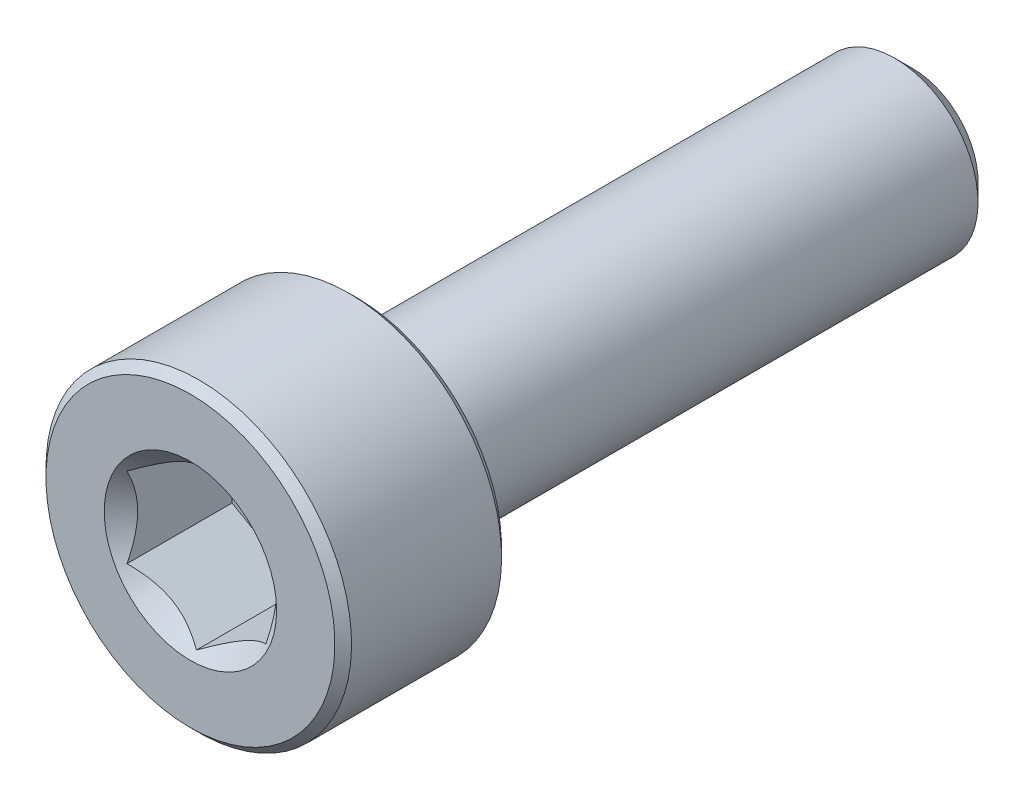
ISO-10303-21;
HEADER;
FILE_DESCRIPTION(('STEP AP214'),'2;1');
FILE_NAME('part.step','',(''),(''),'','','');
FILE_SCHEMA(('AUTOMOTIVE_DESIGN { 1 0 10303 214 1 1 1 1 }'));
ENDSEC;
DATA;
#1=APPLICATION_CONTEXT('core data for automotive mechanical design processes');
#2=APPLICATION_PROTOCOL_DEFINITION('international standard','automotive_design',2000,#1);
#3=PRODUCT_CONTEXT('',#1,'mechanical');
#4=PRODUCT('Part','Part','',(#3));
#5=PRODUCT_RELATED_PRODUCT_CATEGORY('part','',(#4));
#6=PRODUCT_DEFINITION_FORMATION('','',#4);
#7=PRODUCT_DEFINITION_CONTEXT('part definition',#1,'design');
#8=PRODUCT_DEFINITION('design','',#6,#7);
#9=PRODUCT_DEFINITION_SHAPE('','',#8);
#10=(LENGTH_UNIT() NAMED_UNIT(*) SI_UNIT(.MILLI.,.METRE.));
#11=(NAMED_UNIT(*) PLANE_ANGLE_UNIT() SI_UNIT($,.RADIAN.));
#12=(NAMED_UNIT(*) SI_UNIT($,.STERADIAN.) SOLID_ANGLE_UNIT());
#13=UNCERTAINTY_MEASURE_WITH_UNIT(LENGTH_MEASURE(1.E-05),#10,'distance_accuracy_value','');
#14=(GEOMETRIC_REPRESENTATION_CONTEXT(3) GLOBAL_UNCERTAINTY_ASSIGNED_CONTEXT((#13)) GLOBAL_UNIT_ASSIGNED_CONTEXT((#10,
#11,#12)) REPRESENTATION_CONTEXT('',''));
#15=CARTESIAN_POINT('',(0.,0.,0.));
#16=DIRECTION('',(0.,0.,1.));
#17=DIRECTION('',(1.,0.,0.));
#18=AXIS2_PLACEMENT_3D('',#15,#16,#17);
#19=CARTESIAN_POINT('',(0.,1.17524047358084,-6.5));
#20=DIRECTION('',(0.,0.,-1.));
#21=DIRECTION('',(0.,1.,0.));
#22=AXIS2_PLACEMENT_3D('',#19,#20,#21);
#23=PLANE('',#22);
#24=CARTESIAN_POINT('',(0.,0.,-6.5));
#25=DIRECTION('',(0.,0.,-1.));
#26=DIRECTION('',(0.,1.,0.));
#27=AXIS2_PLACEMENT_3D('',#24,#25,#26);
#28=CIRCLE('',#27,1.17524047358084);
#29=CARTESIAN_POINT('',(0.,1.17524047358084,-6.5));
#30=VERTEX_POINT('',#29);
#31=EDGE_CURVE('E54',#30,#30,#28,.T.);
#32=ORIENTED_EDGE('',*,*,#31,.T.);
#33=EDGE_LOOP('',(#32));
#34=FACE_BOUND('',#33,.T.);
#35=ADVANCED_FACE('F41',(#34),#23,.T.);
#36=CARTESIAN_POINT('',(0.,0.,-6.5));
#37=DIRECTION('',(0.,0.,1.));
#38=DIRECTION('',(0.,-1.,0.));
#39=AXIS2_PLACEMENT_3D('',#36,#37,#38);
#40=CONICAL_SURFACE('',#39,1.17524047358084,0.785398163397444);
#41=CARTESIAN_POINT('',(0.,0.,-6.17524047358083));
#42=DIRECTION('',(0.,0.,-1.));
#43=DIRECTION('',(0.,1.,0.));
#44=AXIS2_PLACEMENT_3D('',#41,#42,#43);
#45=CIRCLE('',#44,1.5);
#46=CARTESIAN_POINT('',(0.,1.5,-6.17524047358083));
#47=VERTEX_POINT('',#46);
#48=EDGE_CURVE('E157',#47,#47,#45,.T.);
#49=ORIENTED_EDGE('',*,*,#48,.T.);
#50=EDGE_LOOP('',(#49));
#51=FACE_BOUND('',#50,.T.);
#52=ORIENTED_EDGE('',*,*,#31,.F.);
#53=EDGE_LOOP('',(#52));
#54=FACE_BOUND('',#53,.T.);
#55=ADVANCED_FACE('F163',(#51,#54),#40,.T.);
#56=CARTESIAN_POINT('',(0.,0.,-6.5));
#57=DIRECTION('',(0.,0.,-1.));
#58=DIRECTION('',(0.,1.,0.));
#59=AXIS2_PLACEMENT_3D('',#56,#57,#58);
#60=CYLINDRICAL_SURFACE('',#59,1.5);
#61=CARTESIAN_POINT('',(0.,0.,3.35));
#62=DIRECTION('',(0.,0.,-1.));
#63=DIRECTION('',(0.,1.,0.));
#64=AXIS2_PLACEMENT_3D('',#61,#62,#63);
#65=CIRCLE('',#64,1.5);
#66=CARTESIAN_POINT('',(0.,1.5,3.35));
#67=VERTEX_POINT('',#66);
#68=EDGE_CURVE('E154',#67,#67,#65,.T.);
#69=ORIENTED_EDGE('',*,*,#68,.T.);
#70=EDGE_LOOP('',(#69));
#71=FACE_BOUND('',#70,.T.);
#72=ORIENTED_EDGE('',*,*,#48,.F.);
#73=EDGE_LOOP('',(#72));
#74=FACE_BOUND('',#73,.T.);
#75=ADVANCED_FACE('F165',(#71,#74),#60,.T.);
#76=CARTESIAN_POINT('',(0.,0.,3.35));
#77=DIRECTION('',(0.,0.,-1.));
#78=DIRECTION('',(0.,1.,0.));
#79=AXIS2_PLACEMENT_3D('',#76,#77,#78);
#80=TOROIDAL_SURFACE('',#79,1.65,0.15);
#81=CARTESIAN_POINT('',(0.,0.,3.5));
#82=DIRECTION('',(0.,0.,-1.));
#83=DIRECTION('',(0.,1.,0.));
#84=AXIS2_PLACEMENT_3D('',#81,#82,#83);
#85=CIRCLE('',#84,1.65);
#86=CARTESIAN_POINT('',(0.,1.65,3.5));
#87=VERTEX_POINT('',#86);
#88=EDGE_CURVE('E151',#87,#87,#85,.T.);
#89=ORIENTED_EDGE('',*,*,#88,.T.);
#90=EDGE_LOOP('',(#89));
#91=FACE_BOUND('',#90,.T.);
#92=ORIENTED_EDGE('',*,*,#68,.F.);
#93=EDGE_LOOP('',(#92));
#94=FACE_BOUND('',#93,.T.);
#95=ADVANCED_FACE('F171',(#91,#94),#80,.F.);
#96=CARTESIAN_POINT('',(0.,2.6,3.5));
#97=DIRECTION('',(0.,0.,-1.));
#98=DIRECTION('',(0.,1.,0.));
#99=AXIS2_PLACEMENT_3D('',#96,#97,#98);
#100=PLANE('',#99);
#101=CARTESIAN_POINT('',(0.,0.,3.5));
#102=DIRECTION('',(0.,0.,-1.));
#103=DIRECTION('',(0.,1.,0.));
#104=AXIS2_PLACEMENT_3D('',#101,#102,#103);
#105=CIRCLE('',#104,2.6);
#106=CARTESIAN_POINT('',(0.,2.6,3.5));
#107=VERTEX_POINT('',#106);
#108=EDGE_CURVE('E148',#107,#107,#105,.T.);
#109=ORIENTED_EDGE('',*,*,#108,.T.);
#110=EDGE_LOOP('',(#109));
#111=FACE_BOUND('',#110,.T.);
#112=ORIENTED_EDGE('',*,*,#88,.F.);
#113=EDGE_LOOP('',(#112));
#114=FACE_BOUND('',#113,.T.);
#115=ADVANCED_FACE('F177',(#111,#114),#100,.T.);
#116=CARTESIAN_POINT('',(0.,0.,3.5));
#117=DIRECTION('',(0.,0.,1.));
#118=DIRECTION('',(0.,-1.,0.));
#119=AXIS2_PLACEMENT_3D('',#116,#117,#118);
#120=CONICAL_SURFACE('',#119,2.6,0.785398163397445);
#121=CARTESIAN_POINT('',(0.,0.,3.65));
#122=DIRECTION('',(0.,0.,-1.));
#123=DIRECTION('',(0.,1.,0.));
#124=AXIS2_PLACEMENT_3D('',#121,#122,#123);
#125=CIRCLE('',#124,2.75);
#126=CARTESIAN_POINT('',(0.,2.75,3.65));
#127=VERTEX_POINT('',#126);
#128=EDGE_CURVE('E145',#127,#127,#125,.T.);
#129=ORIENTED_EDGE('',*,*,#128,.T.);
#130=EDGE_LOOP('',(#129));
#131=FACE_BOUND('',#130,.T.);
#132=ORIENTED_EDGE('',*,*,#108,.F.);
#133=EDGE_LOOP('',(#132));
#134=FACE_BOUND('',#133,.T.);
#135=ADVANCED_FACE('F181',(#131,#134),#120,.T.);
#136=CARTESIAN_POINT('',(0.,0.,-6.5));
#137=DIRECTION('',(0.,0.,-1.));
#138=DIRECTION('',(0.,1.,0.));
#139=AXIS2_PLACEMENT_3D('',#136,#137,#138);
#140=CYLINDRICAL_SURFACE('',#139,2.75);
#141=CARTESIAN_POINT('',(0.,0.,6.35));
#142=DIRECTION('',(0.,0.,-1.));
#143=DIRECTION('',(0.,1.,0.));
#144=AXIS2_PLACEMENT_3D('',#141,#142,#143);
#145=CIRCLE('',#144,2.75);
#146=CARTESIAN_POINT('',(0.,2.75,6.35));
#147=VERTEX_POINT('',#146);
#148=EDGE_CURVE('E142',#147,#147,#145,.T.);
#149=ORIENTED_EDGE('',*,*,#148,.T.);
#150=EDGE_LOOP('',(#149));
#151=FACE_BOUND('',#150,.T.);
#152=ORIENTED_EDGE('',*,*,#128,.F.);
#153=EDGE_LOOP('',(#152));
#154=FACE_BOUND('',#153,.T.);
#155=ADVANCED_FACE('F185',(#151,#154),#140,.T.);
#156=CARTESIAN_POINT('',(0.,0.,6.35));
#157=DIRECTION('',(0.,0.,-1.));
#158=DIRECTION('',(0.,1.,0.));
#159=AXIS2_PLACEMENT_3D('',#156,#157,#158);
#160=CONICAL_SURFACE('',#159,2.75,0.785398163397451);
#161=CARTESIAN_POINT('',(0.,0.,6.5));
#162=DIRECTION('',(0.,0.,-1.));
#163=DIRECTION('',(0.,1.,0.));
#164=AXIS2_PLACEMENT_3D('',#161,#162,#163);
#165=CIRCLE('',#164,2.6);
#166=CARTESIAN_POINT('',(0.,2.6,6.5));
#167=VERTEX_POINT('',#166);
#168=EDGE_CURVE('E139',#167,#167,#165,.T.);
#169=ORIENTED_EDGE('',*,*,#168,.T.);
#170=EDGE_LOOP('',(#169));
#171=FACE_BOUND('',#170,.T.);
#172=ORIENTED_EDGE('',*,*,#148,.F.);
#173=EDGE_LOOP('',(#172));
#174=FACE_BOUND('',#173,.T.);
#175=ADVANCED_FACE('F189',(#171,#174),#160,.T.);
#176=CARTESIAN_POINT('',(0.,0.,6.5));
#177=DIRECTION('',(0.,0.,1.));
#178=DIRECTION('',(0.,-1.,0.));
#179=AXIS2_PLACEMENT_3D('',#176,#177,#178);
#180=PLANE('',#179);
#181=CARTESIAN_POINT('',(0.,0.,6.5));
#182=DIRECTION('',(0.,0.,1.));
#183=DIRECTION('',(1.,0.,0.));
#184=AXIS2_PLACEMENT_3D('',#181,#182,#183);
#185=CIRCLE('',#184,1.55162884844712);
#186=CARTESIAN_POINT('',(1.55162884844712,0.,6.5));
#187=VERTEX_POINT('',#186);
#188=EDGE_CURVE('E113',#187,#187,#185,.T.);
#189=ORIENTED_EDGE('',*,*,#188,.F.);
#190=EDGE_LOOP('',(#189));
#191=FACE_BOUND('',#190,.T.);
#192=ORIENTED_EDGE('',*,*,#168,.F.);
#193=EDGE_LOOP('',(#192));
#194=FACE_BOUND('',#193,.T.);
#195=ADVANCED_FACE('F193',(#191,#194),#180,.T.);
#196=CARTESIAN_POINT('',(0.,0.,6.5));
#197=DIRECTION('',(0.,0.,1.));
#198=DIRECTION('',(1.,0.,0.));
#199=AXIS2_PLACEMENT_3D('',#196,#197,#198);
#200=CONICAL_SURFACE('',#199,1.55162884844712,0.78539816339745);
#201=ORIENTED_EDGE('',*,*,#188,.T.);
#202=EDGE_LOOP('',(#201));
#203=FACE_BOUND('',#202,.T.);
#204=CARTESIAN_POINT('',(-0.000199999999999347,-1.4434911430279,6.39186230843608));
#205=CARTESIAN_POINT('',(0.0427751670715874,-1.41867941875065,6.36706849258205));
#206=CARTESIAN_POINT('',(0.0864690047459488,-1.39345276980743,6.34373055894563));
#207=CARTESIAN_POINT('',(0.175565930841943,-1.34201263554194,6.30099882861148));
#208=CARTESIAN_POINT('',(0.220977498357065,-1.31579425481276,6.28162881688736));
#209=CARTESIAN_POINT('',(0.312547820935261,-1.26292610442246,6.24844730794042));
#210=CARTESIAN_POINT('',(0.358683240175886,-1.23628980770471,6.2345523835796));
#211=CARTESIAN_POINT('',(0.451970080407593,-1.18243062538508,6.21314410668758));
#212=CARTESIAN_POINT('',(0.499118649136381,-1.15520938653761,6.20561476609373));
#213=CARTESIAN_POINT('',(0.580373556887253,-1.10829684367467,6.19882132257765));
#214=CARTESIAN_POINT('',(0.614374876627942,-1.08866617256958,6.1978153836313));
#215=CARTESIAN_POINT('',(0.682317764432479,-1.04943932800611,6.19950823943826));
#216=CARTESIAN_POINT('',(0.716259317655659,-1.02984316311599,6.20220785174248));
#217=CARTESIAN_POINT('',(0.783814856457501,-0.990839954603499,6.21115575484332));
#218=CARTESIAN_POINT('',(0.817428507286776,-0.971433104248771,6.21740735042665));
#219=CARTESIAN_POINT('',(0.884094638217814,-0.932943395609905,6.23312250594085));
#220=CARTESIAN_POINT('',(0.917146871030297,-0.9138606800983,6.2425874446144));
#221=CARTESIAN_POINT('',(1.00179969160027,-0.864986351354567,6.27067821521453));
#222=CARTESIAN_POINT('',(1.05286649242964,-0.835502920149075,6.29141698197915));
#223=CARTESIAN_POINT('',(1.15300085411326,-0.777690319475908,6.33813395919842));
#224=CARTESIAN_POINT('',(1.20207431157827,-0.749357745598417,6.36409512047371));
#225=CARTESIAN_POINT('',(1.2502,-0.721572366433194,6.39186230843608));
#226=B_SPLINE_CURVE_WITH_KNOTS('',3,(#204,#205,#206,#207,#208,#209,#210,#211,#212,#213,#214,
#215,#216,#217,#218,#219,#220,#221,#222,#223,#224,#225),.UNSPECIFIED.,.F.,.F.,(4,2,2,2,2,2,2,2,
2,2,4),(0.,0.166533409618304,0.334037607289762,0.498880396489698,0.663307919240275,
0.780963963458827,0.898645970148454,1.01643764860773,1.1342799317155,1.32148652032141,
1.50809158792573),.UNSPECIFIED.);
#227=CARTESIAN_POINT('',(0.,-1.44337567297406,6.39174682452695));
#228=VERTEX_POINT('',#227);
#229=CARTESIAN_POINT('',(1.25,-0.721687836487032,6.39174682452694));
#230=VERTEX_POINT('',#229);
#231=EDGE_CURVE('E12',#228,#230,#226,.T.);
#232=ORIENTED_EDGE('',*,*,#231,.F.);
#233=CARTESIAN_POINT('',(-1.2502,-0.721572366433195,6.39186230843608));
#234=CARTESIAN_POINT('',(-1.20722483292841,-0.746384090710444,6.36706849258205));
#235=CARTESIAN_POINT('',(-1.16353099525405,-0.771610739653664,6.34373055894563));
#236=CARTESIAN_POINT('',(-1.07443406915806,-0.823050873919155,6.30099882861148));
#237=CARTESIAN_POINT('',(-1.02902250164294,-0.849269254648333,6.28162881688736));
#238=CARTESIAN_POINT('',(-0.93745217906474,-0.902137405038635,6.24844730794042));
#239=CARTESIAN_POINT('',(-0.891316759824114,-0.928773701756387,6.2345523835796));
#240=CARTESIAN_POINT('',(-0.798029919592408,-0.982632884076012,6.21314410668758));
#241=CARTESIAN_POINT('',(-0.75088135086362,-1.00985412292348,6.20561476609373));
#242=CARTESIAN_POINT('',(-0.669626443112748,-1.05676666578643,6.19882132257765));
#243=CARTESIAN_POINT('',(-0.635625123372059,-1.07639733689152,6.1978153836313));
#244=CARTESIAN_POINT('',(-0.567682235567523,-1.11562418145499,6.19950823943826));
#245=CARTESIAN_POINT('',(-0.533740682344343,-1.1352203463451,6.20220785174248));
#246=CARTESIAN_POINT('',(-0.466185143542501,-1.1742235548576,6.21115575484332));
#247=CARTESIAN_POINT('',(-0.432571492713225,-1.19363040521233,6.21740735042665));
#248=CARTESIAN_POINT('',(-0.365905361782187,-1.23212011385119,6.23312250594085));
#249=CARTESIAN_POINT('',(-0.332853128969705,-1.2512028293628,6.2425874446144));
#250=CARTESIAN_POINT('',(-0.248200308399736,-1.30007715810653,6.27067821521453));
#251=CARTESIAN_POINT('',(-0.197133507570362,-1.32956058931202,6.29141698197915));
#252=CARTESIAN_POINT('',(-0.0969991458867446,-1.38737318998519,6.33813395919842));
#253=CARTESIAN_POINT('',(-0.0479256884217298,-1.41570576386268,6.36409512047371));
#254=CARTESIAN_POINT('',(0.000200000000000719,-1.4434911430279,6.39186230843608));
#255=B_SPLINE_CURVE_WITH_KNOTS('',3,(#233,#234,#235,#236,#237,#238,#239,#240,#241,#242,#243,
#244,#245,#246,#247,#248,#249,#250,#251,#252,#253,#254),.UNSPECIFIED.,.F.,.F.,(4,2,2,2,2,2,2,2,
2,2,4),(0.,0.166533409618303,0.334037607289761,0.498880396489698,0.663307919240274,
0.780963963458826,0.898645970148452,1.01643764860773,1.13427993171549,1.32148652032141,
1.50809158792574),.UNSPECIFIED.);
#256=CARTESIAN_POINT('',(-1.25,-0.721687836487032,6.39174682452694));
#257=VERTEX_POINT('',#256);
#258=EDGE_CURVE('E99',#257,#228,#255,.T.);
#259=ORIENTED_EDGE('',*,*,#258,.F.);
#260=CARTESIAN_POINT('',(-1.25,-1.52022146239345,6.91651070319084));
#261=CARTESIAN_POINT('',(-1.25,-1.48354689134962,6.88818689718723));
#262=CARTESIAN_POINT('',(-1.25,-1.44667707589305,6.86011672093047));
#263=CARTESIAN_POINT('',(-1.25,-1.37246477804769,6.80459065501776));
#264=CARTESIAN_POINT('',(-1.25,-1.33512218721453,6.77713491044787));
#265=CARTESIAN_POINT('',(-1.25,-1.22171630832114,6.69545809771049));
#266=CARTESIAN_POINT('',(-1.25,-1.14482995781092,6.6423614251193));
#267=CARTESIAN_POINT('',(-1.25,-0.983056768942587,6.53734973416941));
#268=CARTESIAN_POINT('',(-1.25,-0.897974111811057,6.48573326925832));
#269=CARTESIAN_POINT('',(-1.25,-0.723462355215556,6.39078355108508));
#270=CARTESIAN_POINT('',(-1.25,-0.634049271919706,6.34742232185916));
#271=CARTESIAN_POINT('',(-1.25,-0.5005887711437,6.29435177040724));
#272=CARTESIAN_POINT('',(-1.25,-0.45869172620811,6.27926501327173));
#273=CARTESIAN_POINT('',(-1.25,-0.373815329706779,6.25244749770266));
#274=CARTESIAN_POINT('',(-1.25,-0.330835910419723,6.24071694982871));
#275=CARTESIAN_POINT('',(-1.25,-0.244810833071148,6.22144313304601));
#276=CARTESIAN_POINT('',(-1.25,-0.20178270746757,6.21382289169453));
#277=CARTESIAN_POINT('',(-1.25,-0.115176247984995,6.20293190707962));
#278=CARTESIAN_POINT('',(-1.25,-0.0715980347745597,6.1996602260857));
#279=CARTESIAN_POINT('',(-1.25,0.0136806197531966,6.19775210045869));
#280=CARTESIAN_POINT('',(-1.25,0.0553765370047047,6.19891205716704));
#281=CARTESIAN_POINT('',(-1.25,0.13844909645316,6.20533266388464));
#282=CARTESIAN_POINT('',(-1.25,0.179825709781942,6.21059368038276));
#283=CARTESIAN_POINT('',(-1.25,0.262662840763598,6.22500574721218));
#284=CARTESIAN_POINT('',(-1.25,0.304111120669651,6.23422600730023));
#285=CARTESIAN_POINT('',(-1.25,0.386089884230834,6.25604235623938));
#286=CARTESIAN_POINT('',(-1.25,0.426620414510369,6.26863827317792));
#287=CARTESIAN_POINT('',(-1.25,0.550794781768362,6.3120595916479));
#288=CARTESIAN_POINT('',(-1.25,0.632755591043412,6.34768282700966));
#289=CARTESIAN_POINT('',(-1.25,0.792852508946382,6.42696814455953));
#290=CARTESIAN_POINT('',(-1.25,0.870973935410876,6.47065844211049));
#291=CARTESIAN_POINT('',(-1.25,1.02031328199646,6.56088158787621));
#292=CARTESIAN_POINT('',(-1.25,1.09168171050215,6.60716845879521));
#293=CARTESIAN_POINT('',(-1.25,1.19682802849918,6.67876149953674));
#294=CARTESIAN_POINT('',(-1.25,1.2314248214359,6.70288582787532));
#295=CARTESIAN_POINT('',(-1.25,1.30014350643268,6.75178258410313));
#296=CARTESIAN_POINT('',(-1.25,1.33426552680451,6.7765548314612));
#297=CARTESIAN_POINT('',(-1.25,1.36818950249276,6.8015960474388));
#298=B_SPLINE_CURVE_WITH_KNOTS('',3,(#260,#261,#262,#263,#264,#265,#266,#267,#268,#269,#270,
#271,#272,#273,#274,#275,#276,#277,#278,#279,#280,#281,#282,#283,#284,#285,#286,#287,#288,#289,
#290,#291,#292,#293,#294,#295,#296,#297),.UNSPECIFIED.,.F.,.F.,(4,2,2,2,2,2,2,2,2,2,2,2,2,2,2,2,
2,2,4),(0.,0.139012369615044,0.278057225136918,0.558259504053771,0.856585057342475,
1.15388088887299,1.28736138903992,1.42085026158167,1.55174393609413,1.68260937990424,
1.80753647715252,1.93247473971975,2.05969207441603,2.18690293152764,2.45422704655832,
2.72250450232039,2.97756898823762,3.10409578574714,3.23058769667827),.UNSPECIFIED.);
#299=CARTESIAN_POINT('',(-1.25,0.721687836487032,6.39174682452694));
#300=VERTEX_POINT('',#299);
#301=EDGE_CURVE('E112',#300,#257,#298,.F.);
#302=ORIENTED_EDGE('',*,*,#301,.F.);
#303=CARTESIAN_POINT('',(0.000199999999999644,1.4434911430279,6.39186230843608));
#304=CARTESIAN_POINT('',(-0.0427751670715868,1.41867941875065,6.36706849258205));
#305=CARTESIAN_POINT('',(-0.0864690047459481,1.39345276980743,6.34373055894563));
#306=CARTESIAN_POINT('',(-0.175565930841942,1.34201263554194,6.30099882861148));
#307=CARTESIAN_POINT('',(-0.220977498357064,1.31579425481276,6.28162881688736));
#308=CARTESIAN_POINT('',(-0.312547820935259,1.26292610442246,6.24844730794042));
#309=CARTESIAN_POINT('',(-0.358683240175885,1.23628980770471,6.2345523835796));
#310=CARTESIAN_POINT('',(-0.451970080407592,1.18243062538508,6.21314410668758));
#311=CARTESIAN_POINT('',(-0.49911864913638,1.15520938653761,6.20561476609373));
#312=CARTESIAN_POINT('',(-0.580373556887252,1.10829684367467,6.19882132257765));
#313=CARTESIAN_POINT('',(-0.614374876627941,1.08866617256958,6.1978153836313));
#314=CARTESIAN_POINT('',(-0.682317764432477,1.04943932800611,6.19950823943826));
#315=CARTESIAN_POINT('',(-0.716259317655657,1.02984316311599,6.20220785174248));
#316=CARTESIAN_POINT('',(-0.783814856457499,0.990839954603499,6.21115575484332));
#317=CARTESIAN_POINT('',(-0.817428507286774,0.971433104248771,6.21740735042665));
#318=CARTESIAN_POINT('',(-0.884094638217813,0.932943395609905,6.23312250594085));
#319=CARTESIAN_POINT('',(-0.917146871030295,0.9138606800983,6.2425874446144));
#320=CARTESIAN_POINT('',(-1.00179969160026,0.864986351354567,6.27067821521453));
#321=CARTESIAN_POINT('',(-1.05286649242964,0.835502920149075,6.29141698197915));
#322=CARTESIAN_POINT('',(-1.15300085411325,0.777690319475908,6.33813395919842));
#323=CARTESIAN_POINT('',(-1.20207431157827,0.749357745598416,6.36409512047371));
#324=CARTESIAN_POINT('',(-1.2502,0.721572366433194,6.39186230843608));
#325=B_SPLINE_CURVE_WITH_KNOTS('',3,(#303,#304,#305,#306,#307,#308,#309,#310,#311,#312,#313,
#314,#315,#316,#317,#318,#319,#320,#321,#322,#323,#324),.UNSPECIFIED.,.F.,.F.,(4,2,2,2,2,2,2,2,
2,2,4),(0.,0.166533409618303,0.334037607289761,0.498880396489697,0.663307919240274,
0.780963963458826,0.898645970148452,1.01643764860773,1.13427993171549,1.32148652032141,
1.50809158792574),.UNSPECIFIED.);
#326=CARTESIAN_POINT('',(0.,1.44337567297406,6.39174682452694));
#327=VERTEX_POINT('',#326);
#328=EDGE_CURVE('E243',#327,#300,#325,.T.);
#329=ORIENTED_EDGE('',*,*,#328,.F.);
#330=CARTESIAN_POINT('',(1.2502,0.721572366433194,6.39186230843608));
#331=CARTESIAN_POINT('',(1.20722483292841,0.746384090710444,6.36706849258205));
#332=CARTESIAN_POINT('',(1.16353099525405,0.771610739653664,6.34373055894563));
#333=CARTESIAN_POINT('',(1.07443406915806,0.823050873919154,6.30099882861148));
#334=CARTESIAN_POINT('',(1.02902250164294,0.849269254648333,6.28162881688736));
#335=CARTESIAN_POINT('',(0.93745217906474,0.902137405038635,6.24844730794042));
#336=CARTESIAN_POINT('',(0.891316759824114,0.928773701756387,6.2345523835796));
#337=CARTESIAN_POINT('',(0.798029919592408,0.982632884076012,6.21314410668758));
#338=CARTESIAN_POINT('',(0.750881350863621,1.00985412292348,6.20561476609373));
#339=CARTESIAN_POINT('',(0.669626443112748,1.05676666578643,6.19882132257765));
#340=CARTESIAN_POINT('',(0.635625123372059,1.07639733689152,6.19781538363129));
#341=CARTESIAN_POINT('',(0.567682235567523,1.11562418145499,6.19950823943826));
#342=CARTESIAN_POINT('',(0.533740682344343,1.1352203463451,6.20220785174248));
#343=CARTESIAN_POINT('',(0.466185143542501,1.1742235548576,6.21115575484332));
#344=CARTESIAN_POINT('',(0.432571492713226,1.19363040521233,6.21740735042665));
#345=CARTESIAN_POINT('',(0.365905361782187,1.23212011385119,6.23312250594085));
#346=CARTESIAN_POINT('',(0.332853128969705,1.2512028293628,6.2425874446144));
#347=CARTESIAN_POINT('',(0.248200308399736,1.30007715810653,6.27067821521453));
#348=CARTESIAN_POINT('',(0.197133507570362,1.32956058931202,6.29141698197915));
#349=CARTESIAN_POINT('',(0.0969991458867456,1.38737318998519,6.33813395919842));
#350=CARTESIAN_POINT('',(0.0479256884217306,1.41570576386268,6.36409512047371));
#351=CARTESIAN_POINT('',(-0.000200000000000208,1.4434911430279,6.39186230843608));
#352=B_SPLINE_CURVE_WITH_KNOTS('',3,(#330,#331,#332,#333,#334,#335,#336,#337,#338,#339,#340,
#341,#342,#343,#344,#345,#346,#347,#348,#349,#350,#351),.UNSPECIFIED.,.F.,.F.,(4,2,2,2,2,2,2,2,
2,2,4),(0.,0.166533409618303,0.334037607289761,0.498880396489698,0.663307919240274,
0.780963963458826,0.898645970148452,1.01643764860773,1.13427993171549,1.32148652032141,
1.50809158792574),.UNSPECIFIED.);
#353=CARTESIAN_POINT('',(1.25,0.721687836487032,6.39174682452694));
#354=VERTEX_POINT('',#353);
#355=EDGE_CURVE('E216',#354,#327,#352,.T.);
#356=ORIENTED_EDGE('',*,*,#355,.F.);
#357=CARTESIAN_POINT('',(1.25,-1.52022146239345,6.91651070319084));
#358=CARTESIAN_POINT('',(1.25,-1.48354689134962,6.88818689718723));
#359=CARTESIAN_POINT('',(1.25,-1.44667707589305,6.86011672093047));
#360=CARTESIAN_POINT('',(1.25,-1.37246477804769,6.80459065501776));
#361=CARTESIAN_POINT('',(1.25,-1.33512218721453,6.77713491044787));
#362=CARTESIAN_POINT('',(1.25,-1.22171630832114,6.69545809771049));
#363=CARTESIAN_POINT('',(1.25,-1.14482995781092,6.6423614251193));
#364=CARTESIAN_POINT('',(1.25,-0.983056768942587,6.53734973416941));
#365=CARTESIAN_POINT('',(1.25,-0.897974111811057,6.48573326925832));
#366=CARTESIAN_POINT('',(1.25,-0.723462355215556,6.39078355108508));
#367=CARTESIAN_POINT('',(1.25,-0.634049271919706,6.34742232185916));
#368=CARTESIAN_POINT('',(1.25,-0.500588771143699,6.29435177040724));
#369=CARTESIAN_POINT('',(1.25,-0.45869172620811,6.27926501327173));
#370=CARTESIAN_POINT('',(1.25,-0.373815329706778,6.25244749770266));
#371=CARTESIAN_POINT('',(1.25,-0.330835910419723,6.24071694982871));
#372=CARTESIAN_POINT('',(1.25,-0.244810833071148,6.22144313304601));
#373=CARTESIAN_POINT('',(1.25,-0.20178270746757,6.21382289169453));
#374=CARTESIAN_POINT('',(1.25,-0.115176247984995,6.20293190707962));
#375=CARTESIAN_POINT('',(1.25,-0.0715980347745598,6.1996602260857));
#376=CARTESIAN_POINT('',(1.25,0.0136806197531965,6.19775210045869));
#377=CARTESIAN_POINT('',(1.25,0.0553765370047047,6.19891205716704));
#378=CARTESIAN_POINT('',(1.25,0.13844909645316,6.20533266388464));
#379=CARTESIAN_POINT('',(1.25,0.179825709781942,6.21059368038276));
#380=CARTESIAN_POINT('',(1.25,0.262662840763599,6.22500574721218));
#381=CARTESIAN_POINT('',(1.25,0.304111120669651,6.23422600730023));
#382=CARTESIAN_POINT('',(1.25,0.386089884230835,6.25604235623938));
#383=CARTESIAN_POINT('',(1.25,0.426620414510369,6.26863827317792));
#384=CARTESIAN_POINT('',(1.25,0.550794781768362,6.31205959164791));
#385=CARTESIAN_POINT('',(1.25,0.632755591043412,6.34768282700966));
#386=CARTESIAN_POINT('',(1.25,0.792852508946383,6.42696814455953));
#387=CARTESIAN_POINT('',(1.25,0.870973935410876,6.47065844211049));
#388=CARTESIAN_POINT('',(1.25,1.02031328199646,6.56088158787621));
#389=CARTESIAN_POINT('',(1.25,1.09168171050215,6.60716845879521));
#390=CARTESIAN_POINT('',(1.25,1.19682802849918,6.67876149953674));
#391=CARTESIAN_POINT('',(1.25,1.2314248214359,6.70288582787532));
#392=CARTESIAN_POINT('',(1.25,1.30014350643268,6.75178258410313));
#393=CARTESIAN_POINT('',(1.25,1.33426552680451,6.7765548314612));
#394=CARTESIAN_POINT('',(1.25,1.36818950249276,6.8015960474388));
#395=B_SPLINE_CURVE_WITH_KNOTS('',3,(#357,#358,#359,#360,#361,#362,#363,#364,#365,#366,#367,
#368,#369,#370,#371,#372,#373,#374,#375,#376,#377,#378,#379,#380,#381,#382,#383,#384,#385,#386,
#387,#388,#389,#390,#391,#392,#393,#394),.UNSPECIFIED.,.F.,.F.,(4,2,2,2,2,2,2,2,2,2,2,2,2,2,2,2,
2,2,4),(0.,0.139012369615044,0.278057225136918,0.558259504053771,0.856585057342474,
1.15388088887299,1.28736138903992,1.42085026158167,1.55174393609413,1.68260937990424,
1.80753647715252,1.93247473971975,2.05969207441603,2.18690293152764,2.45422704655832,
2.72250450232039,2.97756898823762,3.10409578574714,3.23058769667827),.UNSPECIFIED.);
#396=EDGE_CURVE('E61',#230,#354,#395,.T.);
#397=ORIENTED_EDGE('',*,*,#396,.F.);
#398=EDGE_LOOP('',(#232,#259,#302,#329,#356,#397));
#399=FACE_BOUND('',#398,.T.);
#400=ADVANCED_FACE('F98',(#203,#399),#200,.F.);
#401=CARTESIAN_POINT('',(0.,2.6,4.5));
#402=DIRECTION('',(0.,0.,-1.));
#403=DIRECTION('',(0.,1.,0.));
#404=AXIS2_PLACEMENT_3D('',#401,#402,#403);
#405=PLANE('',#404);
#406=DIRECTION('',(0.866025403784438,0.5,0.));
#407=VECTOR('',#406,1.);
#408=CARTESIAN_POINT('',(0.,-1.44337567297406,4.5));
#409=LINE('',#408,#407);
#410=CARTESIAN_POINT('',(0.,-1.44337567297406,4.5));
#411=VERTEX_POINT('',#410);
#412=CARTESIAN_POINT('',(1.25,-0.721687836487032,4.5));
#413=VERTEX_POINT('',#412);
#414=EDGE_CURVE('E116',#411,#413,#409,.T.);
#415=ORIENTED_EDGE('',*,*,#414,.T.);
#416=DIRECTION('',(0.,1.,0.));
#417=VECTOR('',#416,1.);
#418=CARTESIAN_POINT('',(1.25,-0.721687836487032,4.5));
#419=LINE('',#418,#417);
#420=CARTESIAN_POINT('',(1.25,0.721687836487032,4.5));
#421=VERTEX_POINT('',#420);
#422=EDGE_CURVE('E68',#413,#421,#419,.T.);
#423=ORIENTED_EDGE('',*,*,#422,.T.);
#424=DIRECTION('',(-0.866025403784439,0.5,0.));
#425=VECTOR('',#424,1.);
#426=CARTESIAN_POINT('',(1.25,0.721687836487032,4.5));
#427=LINE('',#426,#425);
#428=CARTESIAN_POINT('',(0.,1.44337567297406,4.5));
#429=VERTEX_POINT('',#428);
#430=EDGE_CURVE('E124',#421,#429,#427,.T.);
#431=ORIENTED_EDGE('',*,*,#430,.T.);
#432=DIRECTION('',(-0.866025403784439,-0.5,0.));
#433=VECTOR('',#432,1.);
#434=CARTESIAN_POINT('',(0.,1.44337567297406,4.5));
#435=LINE('',#434,#433);
#436=CARTESIAN_POINT('',(-1.25,0.721687836487032,4.5));
#437=VERTEX_POINT('',#436);
#438=EDGE_CURVE('E131',#429,#437,#435,.T.);
#439=ORIENTED_EDGE('',*,*,#438,.T.);
#440=DIRECTION('',(0.,-1.,0.));
#441=VECTOR('',#440,1.);
#442=CARTESIAN_POINT('',(-1.25,0.721687836487032,4.5));
#443=LINE('',#442,#441);
#444=CARTESIAN_POINT('',(-1.25,-0.721687836487033,4.5));
#445=VERTEX_POINT('',#444);
#446=EDGE_CURVE('E127',#437,#445,#443,.T.);
#447=ORIENTED_EDGE('',*,*,#446,.T.);
#448=DIRECTION('',(0.866025403784439,-0.5,0.));
#449=VECTOR('',#448,1.);
#450=CARTESIAN_POINT('',(-1.25,-0.721687836487032,4.5));
#451=LINE('',#450,#449);
#452=EDGE_CURVE('E117',#445,#411,#451,.T.);
#453=ORIENTED_EDGE('',*,*,#452,.T.);
#454=EDGE_LOOP('',(#415,#423,#431,#439,#447,#453));
#455=FACE_BOUND('',#454,.T.);
#456=ADVANCED_FACE('F198',(#455),#405,.F.);
#457=CARTESIAN_POINT('',(0.,-1.44337567297406,-0.318813079129867));
#458=DIRECTION('',(0.5,-0.866025403784438,0.));
#459=DIRECTION('',(0.866025403784438,0.5,0.));
#460=AXIS2_PLACEMENT_3D('',#457,#458,#459);
#461=PLANE('',#460);
#462=DIRECTION('',(0.,0.,1.));
#463=VECTOR('',#462,1.);
#464=CARTESIAN_POINT('',(0.,-1.44337567297406,-0.318813079129867));
#465=LINE('',#464,#463);
#466=EDGE_CURVE('E108',#411,#228,#465,.T.);
#467=ORIENTED_EDGE('',*,*,#466,.T.);
#468=ORIENTED_EDGE('',*,*,#231,.T.);
#469=DIRECTION('',(0.,0.,1.));
#470=VECTOR('',#469,1.);
#471=CARTESIAN_POINT('',(1.25,-0.721687836487032,-0.318813079129867));
#472=LINE('',#471,#470);
#473=EDGE_CURVE('E119',#413,#230,#472,.T.);
#474=ORIENTED_EDGE('',*,*,#473,.F.);
#475=ORIENTED_EDGE('',*,*,#414,.F.);
#476=EDGE_LOOP('',(#467,#468,#474,#475));
#477=FACE_BOUND('',#476,.T.);
#478=ADVANCED_FACE('F115',(#477),#461,.F.);
#479=CARTESIAN_POINT('',(-1.25,-0.721687836487032,-0.318813079129867));
#480=DIRECTION('',(-0.5,-0.866025403784439,0.));
#481=DIRECTION('',(0.866025403784439,-0.5,0.));
#482=AXIS2_PLACEMENT_3D('',#479,#480,#481);
#483=PLANE('',#482);
#484=DIRECTION('',(0.,0.,1.));
#485=VECTOR('',#484,1.);
#486=CARTESIAN_POINT('',(-1.25,-0.721687836487032,-0.318813079129867));
#487=LINE('',#486,#485);
#488=EDGE_CURVE('E111',#445,#257,#487,.T.);
#489=ORIENTED_EDGE('',*,*,#488,.T.);
#490=ORIENTED_EDGE('',*,*,#258,.T.);
#491=ORIENTED_EDGE('',*,*,#466,.F.);
#492=ORIENTED_EDGE('',*,*,#452,.F.);
#493=EDGE_LOOP('',(#489,#490,#491,#492));
#494=FACE_BOUND('',#493,.T.);
#495=ADVANCED_FACE('F107',(#494),#483,.F.);
#496=CARTESIAN_POINT('',(-1.25,0.721687836487032,-0.318813079129867));
#497=DIRECTION('',(-1.,0.,0.));
#498=DIRECTION('',(0.,0.,1.));
#499=AXIS2_PLACEMENT_3D('',#496,#497,#498);
#500=PLANE('',#499);
#501=DIRECTION('',(0.,0.,1.));
#502=VECTOR('',#501,1.);
#503=CARTESIAN_POINT('',(-1.25,0.721687836487032,-0.318813079129867));
#504=LINE('',#503,#502);
#505=EDGE_CURVE('E128',#437,#300,#504,.T.);
#506=ORIENTED_EDGE('',*,*,#505,.T.);
#507=ORIENTED_EDGE('',*,*,#301,.T.);
#508=ORIENTED_EDGE('',*,*,#488,.F.);
#509=ORIENTED_EDGE('',*,*,#446,.F.);
#510=EDGE_LOOP('',(#506,#507,#508,#509));
#511=FACE_BOUND('',#510,.T.);
#512=ADVANCED_FACE('F252',(#511),#500,.F.);
#513=CARTESIAN_POINT('',(0.,1.44337567297406,-0.318813079129867));
#514=DIRECTION('',(-0.5,0.866025403784438,0.));
#515=DIRECTION('',(-0.866025403784439,-0.5,0.));
#516=AXIS2_PLACEMENT_3D('',#513,#514,#515);
#517=PLANE('',#516);
#518=DIRECTION('',(0.,0.,1.));
#519=VECTOR('',#518,1.);
#520=CARTESIAN_POINT('',(0.,1.44337567297406,-0.318813079129867));
#521=LINE('',#520,#519);
#522=EDGE_CURVE('E132',#429,#327,#521,.T.);
#523=ORIENTED_EDGE('',*,*,#522,.T.);
#524=ORIENTED_EDGE('',*,*,#328,.T.);
#525=ORIENTED_EDGE('',*,*,#505,.F.);
#526=ORIENTED_EDGE('',*,*,#438,.F.);
#527=EDGE_LOOP('',(#523,#524,#525,#526));
#528=FACE_BOUND('',#527,.T.);
#529=ADVANCED_FACE('F249',(#528),#517,.F.);
#530=CARTESIAN_POINT('',(1.25,0.721687836487032,-0.318813079129867));
#531=DIRECTION('',(0.5,0.866025403784439,0.));
#532=DIRECTION('',(-0.866025403784439,0.5,0.));
#533=AXIS2_PLACEMENT_3D('',#530,#531,#532);
#534=PLANE('',#533);
#535=DIRECTION('',(0.,0.,1.));
#536=VECTOR('',#535,1.);
#537=CARTESIAN_POINT('',(1.25,0.721687836487032,-0.318813079129867));
#538=LINE('',#537,#536);
#539=EDGE_CURVE('E135',#421,#354,#538,.T.);
#540=ORIENTED_EDGE('',*,*,#539,.T.);
#541=ORIENTED_EDGE('',*,*,#355,.T.);
#542=ORIENTED_EDGE('',*,*,#522,.F.);
#543=ORIENTED_EDGE('',*,*,#430,.F.);
#544=EDGE_LOOP('',(#540,#541,#542,#543));
#545=FACE_BOUND('',#544,.T.);
#546=ADVANCED_FACE('F206',(#545),#534,.F.);
#547=CARTESIAN_POINT('',(1.25,-0.721687836487032,-0.318813079129867));
#548=DIRECTION('',(1.,0.,0.));
#549=DIRECTION('',(0.,0.,-1.));
#550=AXIS2_PLACEMENT_3D('',#547,#548,#549);
#551=PLANE('',#550);
#552=ORIENTED_EDGE('',*,*,#473,.T.);
#553=ORIENTED_EDGE('',*,*,#396,.T.);
#554=ORIENTED_EDGE('',*,*,#539,.F.);
#555=ORIENTED_EDGE('',*,*,#422,.F.);
#556=EDGE_LOOP('',(#552,#553,#554,#555));
#557=FACE_BOUND('',#556,.T.);
#558=ADVANCED_FACE('F202',(#557),#551,.F.);
#559=CLOSED_SHELL('',(#35,#55,#75,#95,#115,#135,#155,#175,#195,#400,#456,#478,#495,#512,#529,
#546,#558));
#560=MANIFOLD_SOLID_BREP('B2',#559);
#561=ADVANCED_BREP_SHAPE_REPRESENTATION('',(#18,#560),#14);
#562=SHAPE_DEFINITION_REPRESENTATION(#9,#561);
ENDSEC;
END-ISO-10303-21;
